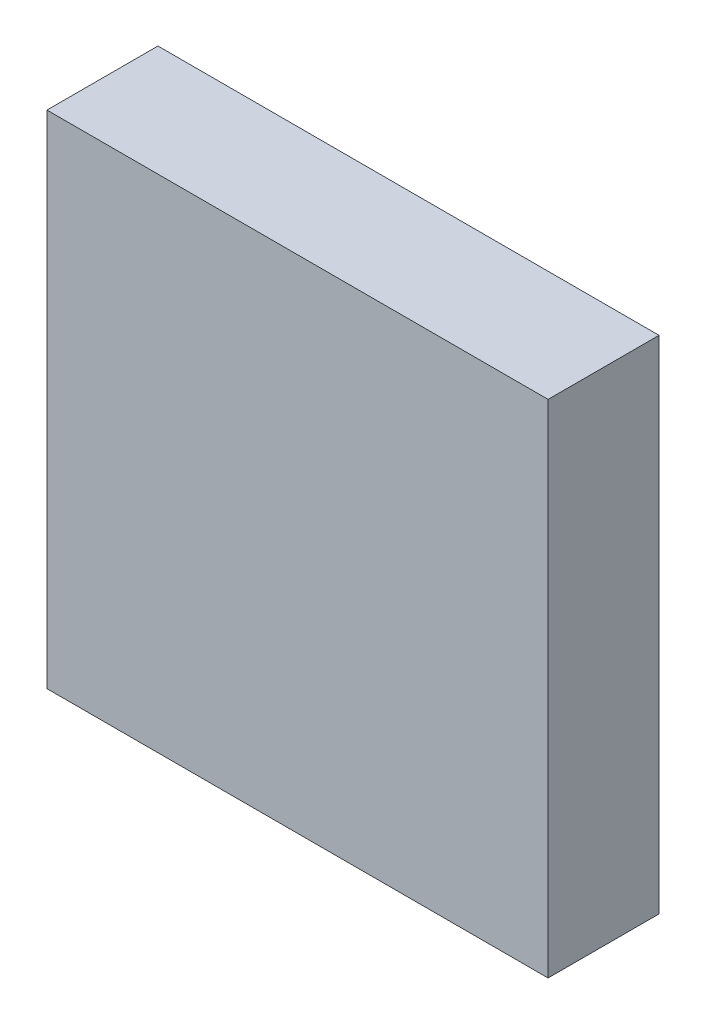
ISO-10303-21;
HEADER;
FILE_DESCRIPTION(('STEP AP214'),'2;1');
FILE_NAME('part.step','',(''),(''),'','','');
FILE_SCHEMA(('AUTOMOTIVE_DESIGN { 1 0 10303 214 1 1 1 1 }'));
ENDSEC;
DATA;
#1=APPLICATION_CONTEXT('core data for automotive mechanical design processes');
#2=APPLICATION_PROTOCOL_DEFINITION('international standard','automotive_design',2000,#1);
#3=PRODUCT_CONTEXT('',#1,'mechanical');
#4=PRODUCT('Part','Part','',(#3));
#5=PRODUCT_RELATED_PRODUCT_CATEGORY('part','',(#4));
#6=PRODUCT_DEFINITION_FORMATION('','',#4);
#7=PRODUCT_DEFINITION_CONTEXT('part definition',#1,'design');
#8=PRODUCT_DEFINITION('design','',#6,#7);
#9=PRODUCT_DEFINITION_SHAPE('','',#8);
#10=(LENGTH_UNIT() NAMED_UNIT(*) SI_UNIT(.MILLI.,.METRE.));
#11=(NAMED_UNIT(*) PLANE_ANGLE_UNIT() SI_UNIT($,.RADIAN.));
#12=(NAMED_UNIT(*) SI_UNIT($,.STERADIAN.) SOLID_ANGLE_UNIT());
#13=UNCERTAINTY_MEASURE_WITH_UNIT(LENGTH_MEASURE(1.E-05),#10,'distance_accuracy_value','');
#14=(GEOMETRIC_REPRESENTATION_CONTEXT(3) GLOBAL_UNCERTAINTY_ASSIGNED_CONTEXT((#13)) GLOBAL_UNIT_ASSIGNED_CONTEXT((#10,
#11,#12)) REPRESENTATION_CONTEXT('',''));
#15=CARTESIAN_POINT('',(0.,0.,0.));
#16=DIRECTION('',(0.,0.,1.));
#17=DIRECTION('',(1.,0.,0.));
#18=AXIS2_PLACEMENT_3D('',#15,#16,#17);
#19=CARTESIAN_POINT('',(3.50000062,-3.49999808,1.54999944));
#20=DIRECTION('',(0.,0.,1.));
#21=DIRECTION('',(1.,0.,0.));
#22=AXIS2_PLACEMENT_3D('',#19,#20,#21);
#23=PLANE('',#22);
#24=DIRECTION('',(0.,1.,0.));
#25=VECTOR('',#24,1.);
#26=CARTESIAN_POINT('',(-3.49999808,-3.49999808,1.54999944));
#27=LINE('',#26,#25);
#28=CARTESIAN_POINT('',(-3.49999808,-3.49999808,1.54999944));
#29=VERTEX_POINT('',#28);
#30=CARTESIAN_POINT('',(-3.49999808,3.50000062,1.54999944));
#31=VERTEX_POINT('',#30);
#32=EDGE_CURVE('E52',#29,#31,#27,.T.);
#33=ORIENTED_EDGE('',*,*,#32,.F.);
#34=DIRECTION('',(1.,0.,0.));
#35=VECTOR('',#34,1.);
#36=CARTESIAN_POINT('',(3.50000062,-3.49999808,1.54999944));
#37=LINE('',#36,#35);
#38=CARTESIAN_POINT('',(3.50000062,-3.49999808,1.54999944));
#39=VERTEX_POINT('',#38);
#40=EDGE_CURVE('E67',#39,#29,#37,.F.);
#41=ORIENTED_EDGE('',*,*,#40,.F.);
#42=DIRECTION('',(0.,1.,0.));
#43=VECTOR('',#42,1.);
#44=CARTESIAN_POINT('',(3.50000062,3.50000062,1.54999944));
#45=LINE('',#44,#43);
#46=CARTESIAN_POINT('',(3.50000062,3.50000062,1.54999944));
#47=VERTEX_POINT('',#46);
#48=EDGE_CURVE('E19',#47,#39,#45,.F.);
#49=ORIENTED_EDGE('',*,*,#48,.F.);
#50=DIRECTION('',(1.,0.,0.));
#51=VECTOR('',#50,1.);
#52=CARTESIAN_POINT('',(-3.49999808,3.50000062,1.54999944));
#53=LINE('',#52,#51);
#54=EDGE_CURVE('E57',#31,#47,#53,.T.);
#55=ORIENTED_EDGE('',*,*,#54,.F.);
#56=EDGE_LOOP('',(#33,#41,#49,#55));
#57=FACE_BOUND('',#56,.T.);
#58=ADVANCED_FACE('F16',(#57),#23,.T.);
#59=CARTESIAN_POINT('',(3.50000062,3.50000062,0.));
#60=DIRECTION('',(1.,0.,0.));
#61=DIRECTION('',(0.,0.,-1.));
#62=AXIS2_PLACEMENT_3D('',#59,#60,#61);
#63=PLANE('',#62);
#64=DIRECTION('',(0.,0.,-1.));
#65=VECTOR('',#64,1.);
#66=CARTESIAN_POINT('',(3.50000062,-3.49999808,0.));
#67=LINE('',#66,#65);
#68=CARTESIAN_POINT('',(3.50000062,-3.49999808,0.));
#69=VERTEX_POINT('',#68);
#70=EDGE_CURVE('E78',#69,#39,#67,.F.);
#71=ORIENTED_EDGE('',*,*,#70,.F.);
#72=DIRECTION('',(0.,1.,0.));
#73=VECTOR('',#72,1.);
#74=CARTESIAN_POINT('',(3.50000062,-3.49999808,0.));
#75=LINE('',#74,#73);
#76=CARTESIAN_POINT('',(3.50000062,3.50000062,0.));
#77=VERTEX_POINT('',#76);
#78=EDGE_CURVE('E73',#69,#77,#75,.T.);
#79=ORIENTED_EDGE('',*,*,#78,.T.);
#80=DIRECTION('',(0.,0.,1.));
#81=VECTOR('',#80,1.);
#82=CARTESIAN_POINT('',(3.50000062,3.50000062,0.));
#83=LINE('',#82,#81);
#84=EDGE_CURVE('E62',#47,#77,#83,.F.);
#85=ORIENTED_EDGE('',*,*,#84,.F.);
#86=ORIENTED_EDGE('',*,*,#48,.T.);
#87=EDGE_LOOP('',(#71,#79,#85,#86));
#88=FACE_BOUND('',#87,.T.);
#89=ADVANCED_FACE('F72',(#88),#63,.T.);
#90=CARTESIAN_POINT('',(-3.49999808,3.50000062,0.));
#91=DIRECTION('',(0.,1.,0.));
#92=DIRECTION('',(0.,0.,1.));
#93=AXIS2_PLACEMENT_3D('',#90,#91,#92);
#94=PLANE('',#93);
#95=ORIENTED_EDGE('',*,*,#84,.T.);
#96=DIRECTION('',(1.,0.,0.));
#97=VECTOR('',#96,1.);
#98=CARTESIAN_POINT('',(3.50000062,3.50000062,0.));
#99=LINE('',#98,#97);
#100=CARTESIAN_POINT('',(-3.49999808,3.50000062,0.));
#101=VERTEX_POINT('',#100);
#102=EDGE_CURVE('E83',#77,#101,#99,.F.);
#103=ORIENTED_EDGE('',*,*,#102,.T.);
#104=DIRECTION('',(0.,0.,1.));
#105=VECTOR('',#104,1.);
#106=CARTESIAN_POINT('',(-3.49999808,3.50000062,0.));
#107=LINE('',#106,#105);
#108=EDGE_CURVE('E64',#31,#101,#107,.F.);
#109=ORIENTED_EDGE('',*,*,#108,.F.);
#110=ORIENTED_EDGE('',*,*,#54,.T.);
#111=EDGE_LOOP('',(#95,#103,#109,#110));
#112=FACE_BOUND('',#111,.T.);
#113=ADVANCED_FACE('F59',(#112),#94,.T.);
#114=CARTESIAN_POINT('',(-3.49999808,-3.49999808,0.));
#115=DIRECTION('',(-1.,0.,0.));
#116=DIRECTION('',(0.,0.,1.));
#117=AXIS2_PLACEMENT_3D('',#114,#115,#116);
#118=PLANE('',#117);
#119=ORIENTED_EDGE('',*,*,#108,.T.);
#120=DIRECTION('',(0.,1.,0.));
#121=VECTOR('',#120,1.);
#122=CARTESIAN_POINT('',(-3.49999808,-3.49999808,0.));
#123=LINE('',#122,#121);
#124=CARTESIAN_POINT('',(-3.49999808,-3.49999808,0.));
#125=VERTEX_POINT('',#124);
#126=EDGE_CURVE('E25',#101,#125,#123,.F.);
#127=ORIENTED_EDGE('',*,*,#126,.T.);
#128=DIRECTION('',(0.,0.,-1.));
#129=VECTOR('',#128,1.);
#130=CARTESIAN_POINT('',(-3.49999808,-3.49999808,0.));
#131=LINE('',#130,#129);
#132=EDGE_CURVE('E33',#29,#125,#131,.T.);
#133=ORIENTED_EDGE('',*,*,#132,.F.);
#134=ORIENTED_EDGE('',*,*,#32,.T.);
#135=EDGE_LOOP('',(#119,#127,#133,#134));
#136=FACE_BOUND('',#135,.T.);
#137=ADVANCED_FACE('F87',(#136),#118,.T.);
#138=CARTESIAN_POINT('',(3.50000062,-3.49999808,0.));
#139=DIRECTION('',(0.,-1.,0.));
#140=DIRECTION('',(0.,0.,-1.));
#141=AXIS2_PLACEMENT_3D('',#138,#139,#140);
#142=PLANE('',#141);
#143=ORIENTED_EDGE('',*,*,#132,.T.);
#144=DIRECTION('',(1.,0.,0.));
#145=VECTOR('',#144,1.);
#146=CARTESIAN_POINT('',(3.50000062,-3.49999808,0.));
#147=LINE('',#146,#145);
#148=EDGE_CURVE('E11',#125,#69,#147,.T.);
#149=ORIENTED_EDGE('',*,*,#148,.T.);
#150=ORIENTED_EDGE('',*,*,#70,.T.);
#151=ORIENTED_EDGE('',*,*,#40,.T.);
#152=EDGE_LOOP('',(#143,#149,#150,#151));
#153=FACE_BOUND('',#152,.T.);
#154=ADVANCED_FACE('F90',(#153),#142,.T.);
#155=CARTESIAN_POINT('',(3.50000062,-3.49999808,0.));
#156=DIRECTION('',(0.,0.,1.));
#157=DIRECTION('',(1.,0.,0.));
#158=AXIS2_PLACEMENT_3D('',#155,#156,#157);
#159=PLANE('',#158);
#160=ORIENTED_EDGE('',*,*,#126,.F.);
#161=ORIENTED_EDGE('',*,*,#102,.F.);
#162=ORIENTED_EDGE('',*,*,#78,.F.);
#163=ORIENTED_EDGE('',*,*,#148,.F.);
#164=EDGE_LOOP('',(#160,#161,#162,#163));
#165=FACE_BOUND('',#164,.T.);
#166=ADVANCED_FACE('F89',(#165),#159,.F.);
#167=CLOSED_SHELL('',(#58,#89,#113,#137,#154,#166));
#168=MANIFOLD_SOLID_BREP('B1',#167);
#169=ADVANCED_BREP_SHAPE_REPRESENTATION('',(#18,#168),#14);
#170=SHAPE_DEFINITION_REPRESENTATION(#9,#169);
ENDSEC;
END-ISO-10303-21;
